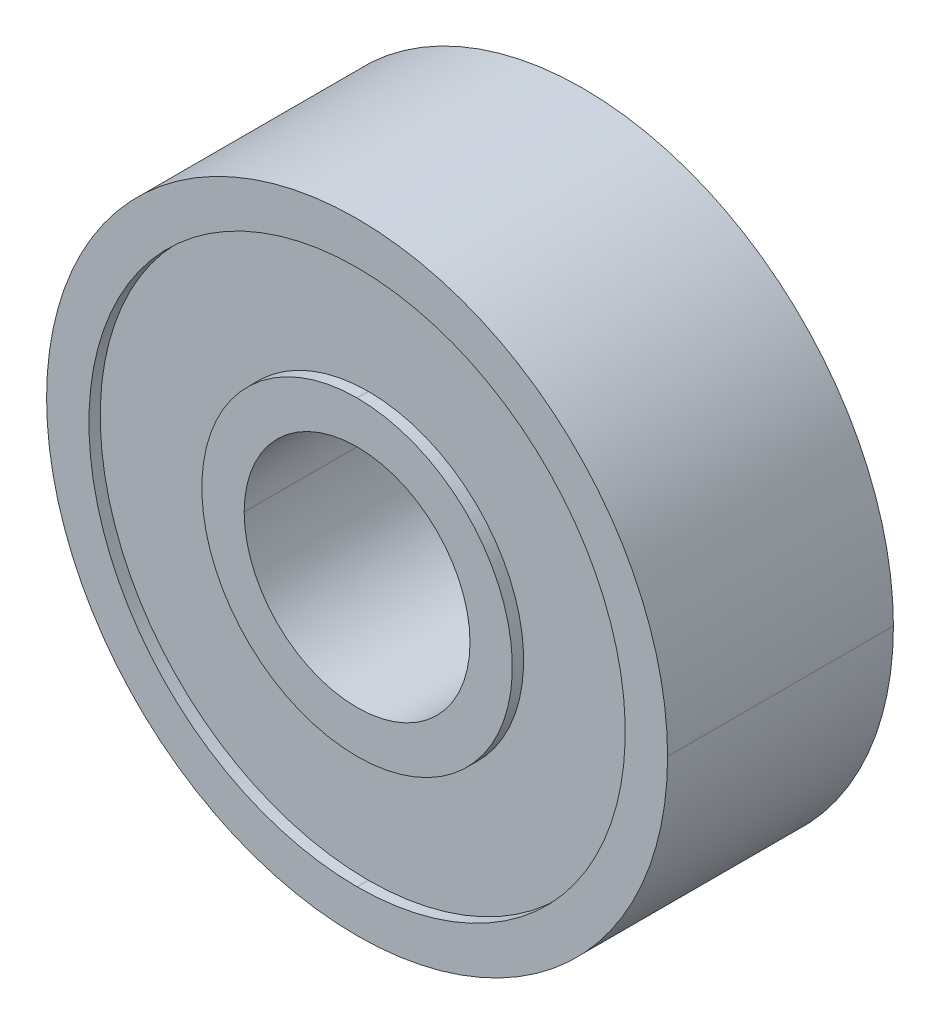
ISO-10303-21;
HEADER;
FILE_DESCRIPTION(('STEP AP214'),'2;1');
FILE_NAME('part.step','',(''),(''),'','','');
FILE_SCHEMA(('AUTOMOTIVE_DESIGN { 1 0 10303 214 1 1 1 1 }'));
ENDSEC;
DATA;
#1=APPLICATION_CONTEXT('core data for automotive mechanical design processes');
#2=APPLICATION_PROTOCOL_DEFINITION('international standard','automotive_design',2000,#1);
#3=PRODUCT_CONTEXT('',#1,'mechanical');
#4=PRODUCT('Part','Part','',(#3));
#5=PRODUCT_RELATED_PRODUCT_CATEGORY('part','',(#4));
#6=PRODUCT_DEFINITION_FORMATION('','',#4);
#7=PRODUCT_DEFINITION_CONTEXT('part definition',#1,'design');
#8=PRODUCT_DEFINITION('design','',#6,#7);
#9=PRODUCT_DEFINITION_SHAPE('','',#8);
#10=(LENGTH_UNIT() NAMED_UNIT(*) SI_UNIT(.MILLI.,.METRE.));
#11=(NAMED_UNIT(*) PLANE_ANGLE_UNIT() SI_UNIT($,.RADIAN.));
#12=(NAMED_UNIT(*) SI_UNIT($,.STERADIAN.) SOLID_ANGLE_UNIT());
#13=UNCERTAINTY_MEASURE_WITH_UNIT(LENGTH_MEASURE(1.E-05),#10,'distance_accuracy_value','');
#14=(GEOMETRIC_REPRESENTATION_CONTEXT(3) GLOBAL_UNCERTAINTY_ASSIGNED_CONTEXT((#13)) GLOBAL_UNIT_ASSIGNED_CONTEXT((#10,
#11,#12)) REPRESENTATION_CONTEXT('',''));
#15=CARTESIAN_POINT('',(0.,0.,0.));
#16=DIRECTION('',(0.,0.,1.));
#17=DIRECTION('',(1.,0.,0.));
#18=AXIS2_PLACEMENT_3D('',#15,#16,#17);
#19=CARTESIAN_POINT('',(0.,0.,0.));
#20=DIRECTION('',(0.,0.,1.));
#21=DIRECTION('',(1.,0.,0.));
#22=AXIS2_PLACEMENT_3D('',#19,#20,#21);
#23=CYLINDRICAL_SURFACE('',#22,2.);
#24=DIRECTION('',(0.,0.,1.));
#25=VECTOR('',#24,1.);
#26=CARTESIAN_POINT('',(2.,0.,0.));
#27=LINE('',#26,#25);
#28=CARTESIAN_POINT('',(2.,0.,0.));
#29=VERTEX_POINT('',#28);
#30=CARTESIAN_POINT('',(2.,0.,4.));
#31=VERTEX_POINT('',#30);
#32=EDGE_CURVE('E131',#29,#31,#27,.T.);
#33=ORIENTED_EDGE('',*,*,#32,.T.);
#34=CARTESIAN_POINT('',(0.,0.,4.));
#35=DIRECTION('',(0.,0.,1.));
#36=DIRECTION('',(1.,0.,0.));
#37=AXIS2_PLACEMENT_3D('',#34,#35,#36);
#38=CIRCLE('',#37,2.);
#39=CARTESIAN_POINT('',(-2.,0.,4.));
#40=VERTEX_POINT('',#39);
#41=EDGE_CURVE('E135',#31,#40,#38,.T.);
#42=ORIENTED_EDGE('',*,*,#41,.T.);
#43=DIRECTION('',(0.,0.,1.));
#44=VECTOR('',#43,1.);
#45=CARTESIAN_POINT('',(-2.,0.,0.));
#46=LINE('',#45,#44);
#47=CARTESIAN_POINT('',(-2.,0.,0.));
#48=VERTEX_POINT('',#47);
#49=EDGE_CURVE('E141',#48,#40,#46,.T.);
#50=ORIENTED_EDGE('',*,*,#49,.F.);
#51=CARTESIAN_POINT('',(0.,0.,0.));
#52=DIRECTION('',(0.,0.,-1.));
#53=DIRECTION('',(-1.,0.,0.));
#54=AXIS2_PLACEMENT_3D('',#51,#52,#53);
#55=CIRCLE('',#54,2.);
#56=EDGE_CURVE('E136',#48,#29,#55,.T.);
#57=ORIENTED_EDGE('',*,*,#56,.T.);
#58=EDGE_LOOP('',(#33,#42,#50,#57));
#59=FACE_BOUND('',#58,.T.);
#60=ADVANCED_FACE('F17',(#59),#23,.F.);
#61=CARTESIAN_POINT('',(0.,0.,0.));
#62=DIRECTION('',(0.,0.,-1.));
#63=DIRECTION('',(0.,1.,0.));
#64=AXIS2_PLACEMENT_3D('',#61,#62,#63);
#65=CYLINDRICAL_SURFACE('',#64,4.75);
#66=DIRECTION('',(0.,0.,-1.));
#67=VECTOR('',#66,1.);
#68=CARTESIAN_POINT('',(0.,4.75,0.2));
#69=LINE('',#68,#67);
#70=CARTESIAN_POINT('',(0.,4.75,0.2));
#71=VERTEX_POINT('',#70);
#72=CARTESIAN_POINT('',(0.,4.75,0.));
#73=VERTEX_POINT('',#72);
#74=EDGE_CURVE('E11',#71,#73,#69,.T.);
#75=ORIENTED_EDGE('',*,*,#74,.F.);
#76=CARTESIAN_POINT('',(0.,0.,0.2));
#77=DIRECTION('',(0.,0.,1.));
#78=DIRECTION('',(0.,1.,0.));
#79=AXIS2_PLACEMENT_3D('',#76,#77,#78);
#80=CIRCLE('',#79,4.75);
#81=CARTESIAN_POINT('',(0.,-4.75,0.2));
#82=VERTEX_POINT('',#81);
#83=EDGE_CURVE('E192',#71,#82,#80,.T.);
#84=ORIENTED_EDGE('',*,*,#83,.T.);
#85=DIRECTION('',(0.,0.,-1.));
#86=VECTOR('',#85,1.);
#87=CARTESIAN_POINT('',(0.,-4.75,0.2));
#88=LINE('',#87,#86);
#89=CARTESIAN_POINT('',(0.,-4.75,0.));
#90=VERTEX_POINT('',#89);
#91=EDGE_CURVE('E28',#82,#90,#88,.T.);
#92=ORIENTED_EDGE('',*,*,#91,.T.);
#93=CARTESIAN_POINT('',(0.,0.,0.));
#94=DIRECTION('',(0.,0.,-1.));
#95=DIRECTION('',(0.,-1.,0.));
#96=AXIS2_PLACEMENT_3D('',#93,#94,#95);
#97=CIRCLE('',#96,4.75);
#98=EDGE_CURVE('E201',#90,#73,#97,.T.);
#99=ORIENTED_EDGE('',*,*,#98,.T.);
#100=EDGE_LOOP('',(#75,#84,#92,#99));
#101=FACE_BOUND('',#100,.T.);
#102=ADVANCED_FACE('F278',(#101),#65,.F.);
#103=CARTESIAN_POINT('',(0.,0.,0.));
#104=DIRECTION('',(0.,0.,-1.));
#105=DIRECTION('',(0.,1.,0.));
#106=AXIS2_PLACEMENT_3D('',#103,#104,#105);
#107=CYLINDRICAL_SURFACE('',#106,4.75);
#108=ORIENTED_EDGE('',*,*,#91,.F.);
#109=CARTESIAN_POINT('',(0.,0.,0.2));
#110=DIRECTION('',(0.,0.,1.));
#111=DIRECTION('',(0.,-1.,0.));
#112=AXIS2_PLACEMENT_3D('',#109,#110,#111);
#113=CIRCLE('',#112,4.75);
#114=EDGE_CURVE('E196',#82,#71,#113,.T.);
#115=ORIENTED_EDGE('',*,*,#114,.T.);
#116=ORIENTED_EDGE('',*,*,#74,.T.);
#117=CARTESIAN_POINT('',(0.,0.,0.));
#118=DIRECTION('',(0.,0.,-1.));
#119=DIRECTION('',(0.,1.,0.));
#120=AXIS2_PLACEMENT_3D('',#117,#118,#119);
#121=CIRCLE('',#120,4.75);
#122=EDGE_CURVE('E191',#73,#90,#121,.T.);
#123=ORIENTED_EDGE('',*,*,#122,.T.);
#124=EDGE_LOOP('',(#108,#115,#116,#123));
#125=FACE_BOUND('',#124,.T.);
#126=ADVANCED_FACE('F283',(#125),#107,.F.);
#127=CARTESIAN_POINT('',(0.,0.,0.2));
#128=DIRECTION('',(0.,0.,-1.));
#129=DIRECTION('',(0.,-1.,0.));
#130=AXIS2_PLACEMENT_3D('',#127,#128,#129);
#131=PLANE('',#130);
#132=CARTESIAN_POINT('',(0.,0.,0.2));
#133=DIRECTION('',(0.,0.,-1.));
#134=DIRECTION('',(0.,1.,0.));
#135=AXIS2_PLACEMENT_3D('',#132,#133,#134);
#136=CIRCLE('',#135,2.75);
#137=CARTESIAN_POINT('',(0.,2.75,0.2));
#138=VERTEX_POINT('',#137);
#139=CARTESIAN_POINT('',(0.,-2.75,0.2));
#140=VERTEX_POINT('',#139);
#141=EDGE_CURVE('E185',#138,#140,#136,.T.);
#142=ORIENTED_EDGE('',*,*,#141,.F.);
#143=CARTESIAN_POINT('',(0.,0.,0.2));
#144=DIRECTION('',(0.,0.,-1.));
#145=DIRECTION('',(0.,-1.,0.));
#146=AXIS2_PLACEMENT_3D('',#143,#144,#145);
#147=CIRCLE('',#146,2.75);
#148=EDGE_CURVE('E186',#140,#138,#147,.T.);
#149=ORIENTED_EDGE('',*,*,#148,.F.);
#150=EDGE_LOOP('',(#142,#149));
#151=FACE_BOUND('',#150,.T.);
#152=ORIENTED_EDGE('',*,*,#83,.F.);
#153=ORIENTED_EDGE('',*,*,#114,.F.);
#154=EDGE_LOOP('',(#152,#153));
#155=FACE_BOUND('',#154,.T.);
#156=ADVANCED_FACE('F227',(#151,#155),#131,.T.);
#157=CARTESIAN_POINT('',(0.,0.,0.));
#158=DIRECTION('',(0.,0.,-1.));
#159=DIRECTION('',(0.,1.,0.));
#160=AXIS2_PLACEMENT_3D('',#157,#158,#159);
#161=CYLINDRICAL_SURFACE('',#160,2.75);
#162=DIRECTION('',(0.,0.,-1.));
#163=VECTOR('',#162,1.);
#164=CARTESIAN_POINT('',(0.,2.75,0.2));
#165=LINE('',#164,#163);
#166=CARTESIAN_POINT('',(0.,2.75,0.));
#167=VERTEX_POINT('',#166);
#168=EDGE_CURVE('E182',#138,#167,#165,.T.);
#169=ORIENTED_EDGE('',*,*,#168,.F.);
#170=ORIENTED_EDGE('',*,*,#141,.T.);
#171=DIRECTION('',(0.,0.,-1.));
#172=VECTOR('',#171,1.);
#173=CARTESIAN_POINT('',(0.,-2.75,0.2));
#174=LINE('',#173,#172);
#175=CARTESIAN_POINT('',(0.,-2.75,0.));
#176=VERTEX_POINT('',#175);
#177=EDGE_CURVE('E213',#140,#176,#174,.T.);
#178=ORIENTED_EDGE('',*,*,#177,.T.);
#179=CARTESIAN_POINT('',(0.,0.,0.));
#180=DIRECTION('',(0.,0.,1.));
#181=DIRECTION('',(0.,-1.,0.));
#182=AXIS2_PLACEMENT_3D('',#179,#180,#181);
#183=CIRCLE('',#182,2.75);
#184=EDGE_CURVE('E238',#176,#167,#183,.T.);
#185=ORIENTED_EDGE('',*,*,#184,.T.);
#186=EDGE_LOOP('',(#169,#170,#178,#185));
#187=FACE_BOUND('',#186,.T.);
#188=ADVANCED_FACE('F221',(#187),#161,.T.);
#189=CARTESIAN_POINT('',(0.,0.,0.));
#190=DIRECTION('',(0.,0.,-1.));
#191=DIRECTION('',(0.,1.,0.));
#192=AXIS2_PLACEMENT_3D('',#189,#190,#191);
#193=CYLINDRICAL_SURFACE('',#192,2.75);
#194=ORIENTED_EDGE('',*,*,#177,.F.);
#195=ORIENTED_EDGE('',*,*,#148,.T.);
#196=ORIENTED_EDGE('',*,*,#168,.T.);
#197=CARTESIAN_POINT('',(0.,0.,0.));
#198=DIRECTION('',(0.,0.,1.));
#199=DIRECTION('',(0.,1.,0.));
#200=AXIS2_PLACEMENT_3D('',#197,#198,#199);
#201=CIRCLE('',#200,2.75);
#202=EDGE_CURVE('E234',#167,#176,#201,.T.);
#203=ORIENTED_EDGE('',*,*,#202,.T.);
#204=EDGE_LOOP('',(#194,#195,#196,#203));
#205=FACE_BOUND('',#204,.T.);
#206=ADVANCED_FACE('F232',(#205),#193,.T.);
#207=CARTESIAN_POINT('',(0.,0.,0.));
#208=DIRECTION('',(0.,0.,1.));
#209=DIRECTION('',(1.,0.,0.));
#210=AXIS2_PLACEMENT_3D('',#207,#208,#209);
#211=PLANE('',#210);
#212=ORIENTED_EDGE('',*,*,#56,.F.);
#213=CARTESIAN_POINT('',(0.,0.,0.));
#214=DIRECTION('',(0.,0.,-1.));
#215=DIRECTION('',(1.,0.,0.));
#216=AXIS2_PLACEMENT_3D('',#213,#214,#215);
#217=CIRCLE('',#216,2.);
#218=EDGE_CURVE('E21',#29,#48,#217,.T.);
#219=ORIENTED_EDGE('',*,*,#218,.F.);
#220=EDGE_LOOP('',(#212,#219));
#221=FACE_BOUND('',#220,.T.);
#222=ORIENTED_EDGE('',*,*,#184,.F.);
#223=ORIENTED_EDGE('',*,*,#202,.F.);
#224=EDGE_LOOP('',(#222,#223));
#225=FACE_BOUND('',#224,.T.);
#226=ADVANCED_FACE('F239',(#221,#225),#211,.F.);
#227=CARTESIAN_POINT('',(0.,0.,0.));
#228=DIRECTION('',(0.,0.,1.));
#229=DIRECTION('',(1.,0.,0.));
#230=AXIS2_PLACEMENT_3D('',#227,#228,#229);
#231=CYLINDRICAL_SURFACE('',#230,2.);
#232=ORIENTED_EDGE('',*,*,#49,.T.);
#233=CARTESIAN_POINT('',(0.,0.,4.));
#234=DIRECTION('',(0.,0.,1.));
#235=DIRECTION('',(-1.,0.,0.));
#236=AXIS2_PLACEMENT_3D('',#233,#234,#235);
#237=CIRCLE('',#236,2.);
#238=EDGE_CURVE('E144',#40,#31,#237,.T.);
#239=ORIENTED_EDGE('',*,*,#238,.T.);
#240=ORIENTED_EDGE('',*,*,#32,.F.);
#241=ORIENTED_EDGE('',*,*,#218,.T.);
#242=EDGE_LOOP('',(#232,#239,#240,#241));
#243=FACE_BOUND('',#242,.T.);
#244=ADVANCED_FACE('F145',(#243),#231,.F.);
#245=CARTESIAN_POINT('',(0.,0.,4.));
#246=DIRECTION('',(0.,0.,1.));
#247=DIRECTION('',(0.,-1.,0.));
#248=AXIS2_PLACEMENT_3D('',#245,#246,#247);
#249=CYLINDRICAL_SURFACE('',#248,2.75);
#250=DIRECTION('',(0.,0.,1.));
#251=VECTOR('',#250,1.);
#252=CARTESIAN_POINT('',(0.,-2.75,3.8));
#253=LINE('',#252,#251);
#254=CARTESIAN_POINT('',(0.,-2.75,3.8));
#255=VERTEX_POINT('',#254);
#256=CARTESIAN_POINT('',(0.,-2.75,4.));
#257=VERTEX_POINT('',#256);
#258=EDGE_CURVE('E161',#255,#257,#253,.T.);
#259=ORIENTED_EDGE('',*,*,#258,.F.);
#260=CARTESIAN_POINT('',(0.,0.,3.8));
#261=DIRECTION('',(0.,0.,1.));
#262=DIRECTION('',(0.,-1.,0.));
#263=AXIS2_PLACEMENT_3D('',#260,#261,#262);
#264=CIRCLE('',#263,2.75);
#265=CARTESIAN_POINT('',(0.,2.75,3.8));
#266=VERTEX_POINT('',#265);
#267=EDGE_CURVE('E168',#255,#266,#264,.T.);
#268=ORIENTED_EDGE('',*,*,#267,.T.);
#269=DIRECTION('',(0.,0.,1.));
#270=VECTOR('',#269,1.);
#271=CARTESIAN_POINT('',(0.,2.75,3.8));
#272=LINE('',#271,#270);
#273=CARTESIAN_POINT('',(0.,2.75,4.));
#274=VERTEX_POINT('',#273);
#275=EDGE_CURVE('E205',#266,#274,#272,.T.);
#276=ORIENTED_EDGE('',*,*,#275,.T.);
#277=CARTESIAN_POINT('',(0.,0.,4.));
#278=DIRECTION('',(0.,0.,-1.));
#279=DIRECTION('',(0.,1.,0.));
#280=AXIS2_PLACEMENT_3D('',#277,#278,#279);
#281=CIRCLE('',#280,2.75);
#282=EDGE_CURVE('E151',#274,#257,#281,.T.);
#283=ORIENTED_EDGE('',*,*,#282,.T.);
#284=EDGE_LOOP('',(#259,#268,#276,#283));
#285=FACE_BOUND('',#284,.T.);
#286=ADVANCED_FACE('F309',(#285),#249,.T.);
#287=CARTESIAN_POINT('',(0.,0.,4.));
#288=DIRECTION('',(0.,0.,1.));
#289=DIRECTION('',(1.,0.,0.));
#290=AXIS2_PLACEMENT_3D('',#287,#288,#289);
#291=PLANE('',#290);
#292=ORIENTED_EDGE('',*,*,#41,.F.);
#293=ORIENTED_EDGE('',*,*,#238,.F.);
#294=EDGE_LOOP('',(#292,#293));
#295=FACE_BOUND('',#294,.T.);
#296=ORIENTED_EDGE('',*,*,#282,.F.);
#297=CARTESIAN_POINT('',(0.,0.,4.));
#298=DIRECTION('',(0.,0.,-1.));
#299=DIRECTION('',(0.,-1.,0.));
#300=AXIS2_PLACEMENT_3D('',#297,#298,#299);
#301=CIRCLE('',#300,2.75);
#302=EDGE_CURVE('E157',#257,#274,#301,.T.);
#303=ORIENTED_EDGE('',*,*,#302,.F.);
#304=EDGE_LOOP('',(#296,#303));
#305=FACE_BOUND('',#304,.T.);
#306=ADVANCED_FACE('F19',(#295,#305),#291,.T.);
#307=CARTESIAN_POINT('',(0.,0.,4.));
#308=DIRECTION('',(0.,0.,1.));
#309=DIRECTION('',(0.,-1.,0.));
#310=AXIS2_PLACEMENT_3D('',#307,#308,#309);
#311=CYLINDRICAL_SURFACE('',#310,2.75);
#312=ORIENTED_EDGE('',*,*,#275,.F.);
#313=CARTESIAN_POINT('',(0.,0.,3.8));
#314=DIRECTION('',(0.,0.,1.));
#315=DIRECTION('',(0.,1.,0.));
#316=AXIS2_PLACEMENT_3D('',#313,#314,#315);
#317=CIRCLE('',#316,2.75);
#318=EDGE_CURVE('E171',#266,#255,#317,.T.);
#319=ORIENTED_EDGE('',*,*,#318,.T.);
#320=ORIENTED_EDGE('',*,*,#258,.T.);
#321=ORIENTED_EDGE('',*,*,#302,.T.);
#322=EDGE_LOOP('',(#312,#319,#320,#321));
#323=FACE_BOUND('',#322,.T.);
#324=ADVANCED_FACE('F340',(#323),#311,.T.);
#325=CARTESIAN_POINT('',(0.,0.,3.8));
#326=DIRECTION('',(0.,0.,1.));
#327=DIRECTION('',(1.,0.,0.));
#328=AXIS2_PLACEMENT_3D('',#325,#326,#327);
#329=PLANE('',#328);
#330=ORIENTED_EDGE('',*,*,#267,.F.);
#331=ORIENTED_EDGE('',*,*,#318,.F.);
#332=EDGE_LOOP('',(#330,#331));
#333=FACE_BOUND('',#332,.T.);
#334=CARTESIAN_POINT('',(0.,0.,3.8));
#335=DIRECTION('',(0.,0.,-1.));
#336=DIRECTION('',(0.,-1.,0.));
#337=AXIS2_PLACEMENT_3D('',#334,#335,#336);
#338=CIRCLE('',#337,4.75);
#339=CARTESIAN_POINT('',(0.,-4.75,3.8));
#340=VERTEX_POINT('',#339);
#341=CARTESIAN_POINT('',(0.,4.75,3.8));
#342=VERTEX_POINT('',#341);
#343=EDGE_CURVE('E172',#340,#342,#338,.T.);
#344=ORIENTED_EDGE('',*,*,#343,.F.);
#345=CARTESIAN_POINT('',(0.,0.,3.8));
#346=DIRECTION('',(0.,0.,-1.));
#347=DIRECTION('',(0.,1.,0.));
#348=AXIS2_PLACEMENT_3D('',#345,#346,#347);
#349=CIRCLE('',#348,4.75);
#350=EDGE_CURVE('E177',#342,#340,#349,.T.);
#351=ORIENTED_EDGE('',*,*,#350,.F.);
#352=EDGE_LOOP('',(#344,#351));
#353=FACE_BOUND('',#352,.T.);
#354=ADVANCED_FACE('F342',(#333,#353),#329,.T.);
#355=CARTESIAN_POINT('',(0.,0.,4.));
#356=DIRECTION('',(0.,0.,1.));
#357=DIRECTION('',(0.,-1.,0.));
#358=AXIS2_PLACEMENT_3D('',#355,#356,#357);
#359=CYLINDRICAL_SURFACE('',#358,4.75);
#360=DIRECTION('',(0.,0.,1.));
#361=VECTOR('',#360,1.);
#362=CARTESIAN_POINT('',(0.,-4.75,3.8));
#363=LINE('',#362,#361);
#364=CARTESIAN_POINT('',(0.,-4.75,4.));
#365=VERTEX_POINT('',#364);
#366=EDGE_CURVE('E176',#340,#365,#363,.T.);
#367=ORIENTED_EDGE('',*,*,#366,.F.);
#368=ORIENTED_EDGE('',*,*,#343,.T.);
#369=DIRECTION('',(0.,0.,1.));
#370=VECTOR('',#369,1.);
#371=CARTESIAN_POINT('',(0.,4.75,3.8));
#372=LINE('',#371,#370);
#373=CARTESIAN_POINT('',(0.,4.75,4.));
#374=VERTEX_POINT('',#373);
#375=EDGE_CURVE('E181',#342,#374,#372,.T.);
#376=ORIENTED_EDGE('',*,*,#375,.T.);
#377=CARTESIAN_POINT('',(0.,0.,4.));
#378=DIRECTION('',(0.,0.,1.));
#379=DIRECTION('',(0.,1.,0.));
#380=AXIS2_PLACEMENT_3D('',#377,#378,#379);
#381=CIRCLE('',#380,4.75);
#382=EDGE_CURVE('E253',#374,#365,#381,.T.);
#383=ORIENTED_EDGE('',*,*,#382,.T.);
#384=EDGE_LOOP('',(#367,#368,#376,#383));
#385=FACE_BOUND('',#384,.T.);
#386=ADVANCED_FACE('F335',(#385),#359,.F.);
#387=CARTESIAN_POINT('',(0.,0.,4.));
#388=DIRECTION('',(0.,0.,1.));
#389=DIRECTION('',(0.,-1.,0.));
#390=AXIS2_PLACEMENT_3D('',#387,#388,#389);
#391=CYLINDRICAL_SURFACE('',#390,4.75);
#392=ORIENTED_EDGE('',*,*,#375,.F.);
#393=ORIENTED_EDGE('',*,*,#350,.T.);
#394=ORIENTED_EDGE('',*,*,#366,.T.);
#395=CARTESIAN_POINT('',(0.,0.,4.));
#396=DIRECTION('',(0.,0.,1.));
#397=DIRECTION('',(0.,-1.,0.));
#398=AXIS2_PLACEMENT_3D('',#395,#396,#397);
#399=CIRCLE('',#398,4.75);
#400=EDGE_CURVE('E212',#365,#374,#399,.T.);
#401=ORIENTED_EDGE('',*,*,#400,.T.);
#402=EDGE_LOOP('',(#392,#393,#394,#401));
#403=FACE_BOUND('',#402,.T.);
#404=ADVANCED_FACE('F328',(#403),#391,.F.);
#405=CARTESIAN_POINT('',(0.,0.,4.));
#406=DIRECTION('',(0.,0.,1.));
#407=DIRECTION('',(1.,0.,0.));
#408=AXIS2_PLACEMENT_3D('',#405,#406,#407);
#409=PLANE('',#408);
#410=ORIENTED_EDGE('',*,*,#382,.F.);
#411=ORIENTED_EDGE('',*,*,#400,.F.);
#412=EDGE_LOOP('',(#410,#411));
#413=FACE_BOUND('',#412,.T.);
#414=CARTESIAN_POINT('',(0.,0.,4.));
#415=DIRECTION('',(0.,0.,-1.));
#416=DIRECTION('',(1.,0.,0.));
#417=AXIS2_PLACEMENT_3D('',#414,#415,#416);
#418=CIRCLE('',#417,5.5);
#419=CARTESIAN_POINT('',(5.5,0.,4.));
#420=VERTEX_POINT('',#419);
#421=CARTESIAN_POINT('',(-5.5,0.,4.));
#422=VERTEX_POINT('',#421);
#423=EDGE_CURVE('E166',#420,#422,#418,.T.);
#424=ORIENTED_EDGE('',*,*,#423,.F.);
#425=CARTESIAN_POINT('',(0.,0.,4.));
#426=DIRECTION('',(0.,0.,-1.));
#427=DIRECTION('',(-1.,0.,0.));
#428=AXIS2_PLACEMENT_3D('',#425,#426,#427);
#429=CIRCLE('',#428,5.5);
#430=EDGE_CURVE('E167',#422,#420,#429,.T.);
#431=ORIENTED_EDGE('',*,*,#430,.F.);
#432=EDGE_LOOP('',(#424,#431));
#433=FACE_BOUND('',#432,.T.);
#434=ADVANCED_FACE('F326',(#413,#433),#409,.T.);
#435=CARTESIAN_POINT('',(0.,0.,0.));
#436=DIRECTION('',(0.,0.,1.));
#437=DIRECTION('',(1.,0.,0.));
#438=AXIS2_PLACEMENT_3D('',#435,#436,#437);
#439=CYLINDRICAL_SURFACE('',#438,5.5);
#440=DIRECTION('',(0.,0.,1.));
#441=VECTOR('',#440,1.);
#442=CARTESIAN_POINT('',(5.5,0.,0.));
#443=LINE('',#442,#441);
#444=CARTESIAN_POINT('',(5.5,0.,0.));
#445=VERTEX_POINT('',#444);
#446=EDGE_CURVE('E163',#445,#420,#443,.T.);
#447=ORIENTED_EDGE('',*,*,#446,.T.);
#448=ORIENTED_EDGE('',*,*,#423,.T.);
#449=DIRECTION('',(0.,0.,1.));
#450=VECTOR('',#449,1.);
#451=CARTESIAN_POINT('',(-5.5,0.,0.));
#452=LINE('',#451,#450);
#453=CARTESIAN_POINT('',(-5.5,0.,0.));
#454=VERTEX_POINT('',#453);
#455=EDGE_CURVE('E187',#454,#422,#452,.T.);
#456=ORIENTED_EDGE('',*,*,#455,.F.);
#457=CARTESIAN_POINT('',(0.,0.,0.));
#458=DIRECTION('',(0.,0.,1.));
#459=DIRECTION('',(-1.,0.,0.));
#460=AXIS2_PLACEMENT_3D('',#457,#458,#459);
#461=CIRCLE('',#460,5.5);
#462=EDGE_CURVE('E202',#454,#445,#461,.T.);
#463=ORIENTED_EDGE('',*,*,#462,.T.);
#464=EDGE_LOOP('',(#447,#448,#456,#463));
#465=FACE_BOUND('',#464,.T.);
#466=ADVANCED_FACE('F320',(#465),#439,.T.);
#467=CARTESIAN_POINT('',(0.,0.,0.));
#468=DIRECTION('',(0.,0.,1.));
#469=DIRECTION('',(1.,0.,0.));
#470=AXIS2_PLACEMENT_3D('',#467,#468,#469);
#471=CYLINDRICAL_SURFACE('',#470,5.5);
#472=ORIENTED_EDGE('',*,*,#455,.T.);
#473=ORIENTED_EDGE('',*,*,#430,.T.);
#474=ORIENTED_EDGE('',*,*,#446,.F.);
#475=CARTESIAN_POINT('',(0.,0.,0.));
#476=DIRECTION('',(0.,0.,1.));
#477=DIRECTION('',(1.,0.,0.));
#478=AXIS2_PLACEMENT_3D('',#475,#476,#477);
#479=CIRCLE('',#478,5.5);
#480=EDGE_CURVE('E197',#445,#454,#479,.T.);
#481=ORIENTED_EDGE('',*,*,#480,.T.);
#482=EDGE_LOOP('',(#472,#473,#474,#481));
#483=FACE_BOUND('',#482,.T.);
#484=ADVANCED_FACE('F323',(#483),#471,.T.);
#485=CARTESIAN_POINT('',(0.,0.,0.));
#486=DIRECTION('',(0.,0.,1.));
#487=DIRECTION('',(1.,0.,0.));
#488=AXIS2_PLACEMENT_3D('',#485,#486,#487);
#489=PLANE('',#488);
#490=ORIENTED_EDGE('',*,*,#98,.F.);
#491=ORIENTED_EDGE('',*,*,#122,.F.);
#492=EDGE_LOOP('',(#490,#491));
#493=FACE_BOUND('',#492,.T.);
#494=ORIENTED_EDGE('',*,*,#462,.F.);
#495=ORIENTED_EDGE('',*,*,#480,.F.);
#496=EDGE_LOOP('',(#494,#495));
#497=FACE_BOUND('',#496,.T.);
#498=ADVANCED_FACE('F281',(#493,#497),#489,.F.);
#499=CLOSED_SHELL('',(#60,#102,#126,#156,#188,#206,#226,#244,#286,#306,#324,#354,#386,#404,#434,
#466,#484,#498));
#500=MANIFOLD_SOLID_BREP('B1',#499);
#501=ADVANCED_BREP_SHAPE_REPRESENTATION('',(#18,#500),#14);
#502=SHAPE_DEFINITION_REPRESENTATION(#9,#501);
ENDSEC;
END-ISO-10303-21;
